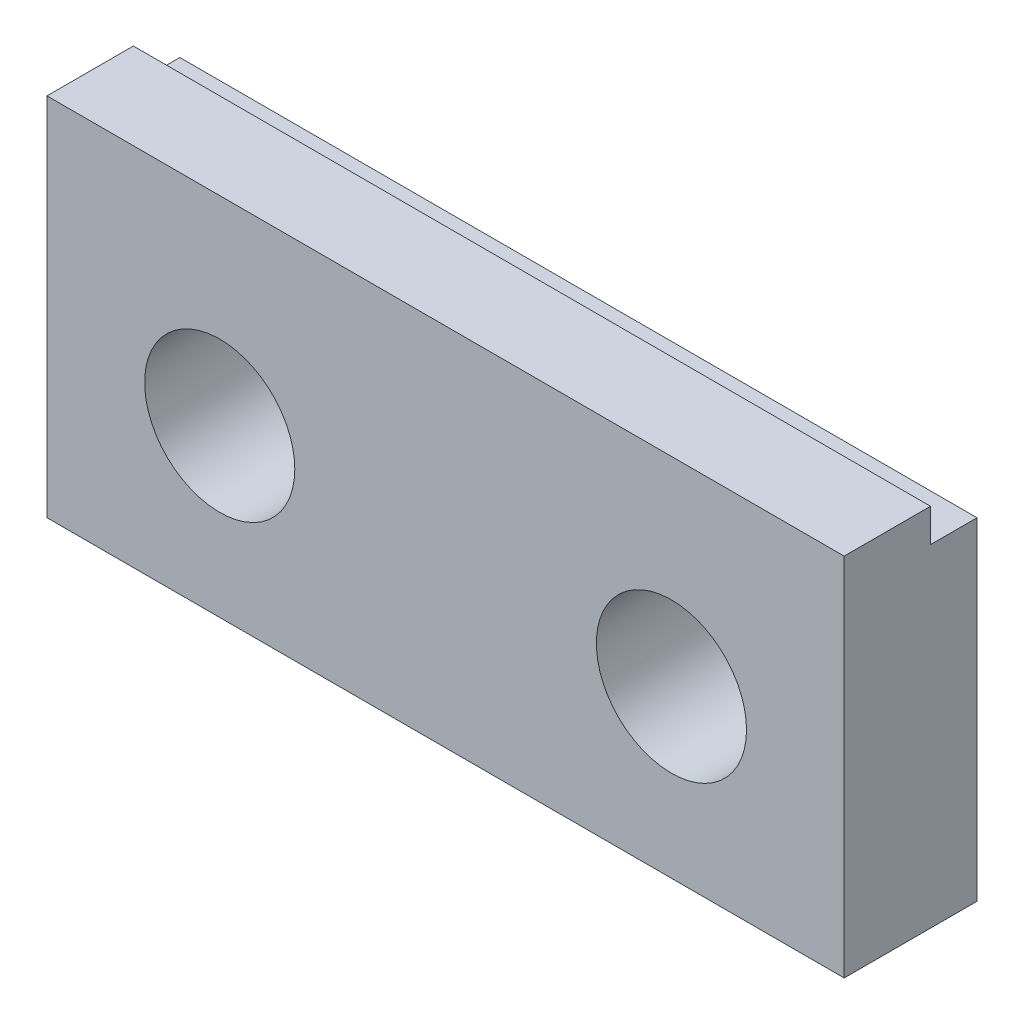
ISO-10303-21;
HEADER;
FILE_DESCRIPTION(('STEP AP214'),'2;1');
FILE_NAME('part.step','',(''),(''),'','','');
FILE_SCHEMA(('AUTOMOTIVE_DESIGN { 1 0 10303 214 1 1 1 1 }'));
ENDSEC;
DATA;
#1=APPLICATION_CONTEXT('core data for automotive mechanical design processes');
#2=APPLICATION_PROTOCOL_DEFINITION('international standard','automotive_design',2000,#1);
#3=PRODUCT_CONTEXT('',#1,'mechanical');
#4=PRODUCT('Part','Part','',(#3));
#5=PRODUCT_RELATED_PRODUCT_CATEGORY('part','',(#4));
#6=PRODUCT_DEFINITION_FORMATION('','',#4);
#7=PRODUCT_DEFINITION_CONTEXT('part definition',#1,'design');
#8=PRODUCT_DEFINITION('design','',#6,#7);
#9=PRODUCT_DEFINITION_SHAPE('','',#8);
#10=(LENGTH_UNIT() NAMED_UNIT(*) SI_UNIT(.MILLI.,.METRE.));
#11=(NAMED_UNIT(*) PLANE_ANGLE_UNIT() SI_UNIT($,.RADIAN.));
#12=(NAMED_UNIT(*) SI_UNIT($,.STERADIAN.) SOLID_ANGLE_UNIT());
#13=UNCERTAINTY_MEASURE_WITH_UNIT(LENGTH_MEASURE(1.E-05),#10,'distance_accuracy_value','');
#14=(GEOMETRIC_REPRESENTATION_CONTEXT(3) GLOBAL_UNCERTAINTY_ASSIGNED_CONTEXT((#13)) GLOBAL_UNIT_ASSIGNED_CONTEXT((#10,
#11,#12)) REPRESENTATION_CONTEXT('',''));
#15=CARTESIAN_POINT('',(0.,0.,0.));
#16=DIRECTION('',(0.,0.,1.));
#17=DIRECTION('',(1.,0.,0.));
#18=AXIS2_PLACEMENT_3D('',#15,#16,#17);
#19=CARTESIAN_POINT('',(-6.,3.,-2.));
#20=DIRECTION('',(-1.,0.,0.));
#21=DIRECTION('',(0.,-1.,0.));
#22=AXIS2_PLACEMENT_3D('',#19,#20,#21);
#23=PLANE('',#22);
#24=DIRECTION('',(0.,0.,-1.));
#25=VECTOR('',#24,1.);
#26=CARTESIAN_POINT('',(-6.,2.5,-2.));
#27=LINE('',#26,#25);
#28=CARTESIAN_POINT('',(-6.,2.5,-1.3));
#29=VERTEX_POINT('',#28);
#30=CARTESIAN_POINT('',(-6.,2.5,-2.));
#31=VERTEX_POINT('',#30);
#32=EDGE_CURVE('E130',#29,#31,#27,.T.);
#33=ORIENTED_EDGE('',*,*,#32,.T.);
#34=DIRECTION('',(0.,-1.,0.));
#35=VECTOR('',#34,1.);
#36=CARTESIAN_POINT('',(-6.,3.,-2.));
#37=LINE('',#36,#35);
#38=CARTESIAN_POINT('',(-6.,-2.5,-2.));
#39=VERTEX_POINT('',#38);
#40=EDGE_CURVE('E100',#31,#39,#37,.T.);
#41=ORIENTED_EDGE('',*,*,#40,.T.);
#42=DIRECTION('',(0.,0.,1.));
#43=VECTOR('',#42,1.);
#44=CARTESIAN_POINT('',(-6.,-2.5,-2.));
#45=LINE('',#44,#43);
#46=CARTESIAN_POINT('',(-6.,-2.5,0.));
#47=VERTEX_POINT('',#46);
#48=EDGE_CURVE('E36',#39,#47,#45,.T.);
#49=ORIENTED_EDGE('',*,*,#48,.T.);
#50=DIRECTION('',(0.,-1.,0.));
#51=VECTOR('',#50,1.);
#52=CARTESIAN_POINT('',(-6.,3.,0.));
#53=LINE('',#52,#51);
#54=CARTESIAN_POINT('',(-6.,3.,0.));
#55=VERTEX_POINT('',#54);
#56=EDGE_CURVE('E88',#55,#47,#53,.T.);
#57=ORIENTED_EDGE('',*,*,#56,.F.);
#58=DIRECTION('',(0.,0.,1.));
#59=VECTOR('',#58,1.);
#60=CARTESIAN_POINT('',(-6.,3.,-2.));
#61=LINE('',#60,#59);
#62=CARTESIAN_POINT('',(-6.,3.,-1.3));
#63=VERTEX_POINT('',#62);
#64=EDGE_CURVE('E11',#63,#55,#61,.T.);
#65=ORIENTED_EDGE('',*,*,#64,.F.);
#66=DIRECTION('',(0.,-1.,0.));
#67=VECTOR('',#66,1.);
#68=CARTESIAN_POINT('',(-6.,3.,-1.3));
#69=LINE('',#68,#67);
#70=EDGE_CURVE('E241',#63,#29,#69,.T.);
#71=ORIENTED_EDGE('',*,*,#70,.T.);
#72=EDGE_LOOP('',(#33,#41,#49,#57,#65,#71));
#73=FACE_BOUND('',#72,.T.);
#74=ADVANCED_FACE('F33',(#73),#23,.T.);
#75=CARTESIAN_POINT('',(-6.,3.,-2.));
#76=DIRECTION('',(0.,1.,0.));
#77=DIRECTION('',(0.,0.,1.));
#78=AXIS2_PLACEMENT_3D('',#75,#76,#77);
#79=PLANE('',#78);
#80=DIRECTION('',(1.,0.,0.));
#81=VECTOR('',#80,1.);
#82=CARTESIAN_POINT('',(-6.,3.,-1.3));
#83=LINE('',#82,#81);
#84=CARTESIAN_POINT('',(6.,3.,-1.3));
#85=VERTEX_POINT('',#84);
#86=EDGE_CURVE('E84',#63,#85,#83,.T.);
#87=ORIENTED_EDGE('',*,*,#86,.F.);
#88=ORIENTED_EDGE('',*,*,#64,.T.);
#89=DIRECTION('',(-1.,0.,0.));
#90=VECTOR('',#89,1.);
#91=CARTESIAN_POINT('',(-6.,3.,0.));
#92=LINE('',#91,#90);
#93=CARTESIAN_POINT('',(6.,3.,0.));
#94=VERTEX_POINT('',#93);
#95=EDGE_CURVE('E81',#94,#55,#92,.T.);
#96=ORIENTED_EDGE('',*,*,#95,.F.);
#97=DIRECTION('',(0.,0.,1.));
#98=VECTOR('',#97,1.);
#99=CARTESIAN_POINT('',(6.,3.,-2.));
#100=LINE('',#99,#98);
#101=EDGE_CURVE('E41',#85,#94,#100,.T.);
#102=ORIENTED_EDGE('',*,*,#101,.F.);
#103=EDGE_LOOP('',(#87,#88,#96,#102));
#104=FACE_BOUND('',#103,.T.);
#105=ADVANCED_FACE('F78',(#104),#79,.T.);
#106=CARTESIAN_POINT('',(6.,3.,-2.));
#107=DIRECTION('',(1.,0.,0.));
#108=DIRECTION('',(0.,0.,-1.));
#109=AXIS2_PLACEMENT_3D('',#106,#107,#108);
#110=PLANE('',#109);
#111=DIRECTION('',(0.,0.,-1.));
#112=VECTOR('',#111,1.);
#113=CARTESIAN_POINT('',(6.,2.5,-2.));
#114=LINE('',#113,#112);
#115=CARTESIAN_POINT('',(6.,2.5,-1.3));
#116=VERTEX_POINT('',#115);
#117=CARTESIAN_POINT('',(6.,2.5,-2.));
#118=VERTEX_POINT('',#117);
#119=EDGE_CURVE('E49',#116,#118,#114,.T.);
#120=ORIENTED_EDGE('',*,*,#119,.F.);
#121=DIRECTION('',(0.,-1.,0.));
#122=VECTOR('',#121,1.);
#123=CARTESIAN_POINT('',(6.,3.,-1.3));
#124=LINE('',#123,#122);
#125=EDGE_CURVE('E237',#85,#116,#124,.T.);
#126=ORIENTED_EDGE('',*,*,#125,.F.);
#127=ORIENTED_EDGE('',*,*,#101,.T.);
#128=DIRECTION('',(0.,1.,0.));
#129=VECTOR('',#128,1.);
#130=CARTESIAN_POINT('',(6.,3.,0.));
#131=LINE('',#130,#129);
#132=CARTESIAN_POINT('',(6.,-2.5,0.));
#133=VERTEX_POINT('',#132);
#134=EDGE_CURVE('E99',#133,#94,#131,.T.);
#135=ORIENTED_EDGE('',*,*,#134,.F.);
#136=DIRECTION('',(0.,0.,1.));
#137=VECTOR('',#136,1.);
#138=CARTESIAN_POINT('',(6.,-2.5,-2.));
#139=LINE('',#138,#137);
#140=CARTESIAN_POINT('',(6.,-2.5,-2.));
#141=VERTEX_POINT('',#140);
#142=EDGE_CURVE('E58',#141,#133,#139,.T.);
#143=ORIENTED_EDGE('',*,*,#142,.F.);
#144=DIRECTION('',(0.,1.,0.));
#145=VECTOR('',#144,1.);
#146=CARTESIAN_POINT('',(6.,3.,-2.));
#147=LINE('',#146,#145);
#148=EDGE_CURVE('E109',#141,#118,#147,.T.);
#149=ORIENTED_EDGE('',*,*,#148,.T.);
#150=EDGE_LOOP('',(#120,#126,#127,#135,#143,#149));
#151=FACE_BOUND('',#150,.T.);
#152=ADVANCED_FACE('F159',(#151),#110,.T.);
#153=CARTESIAN_POINT('',(-6.,-2.5,-2.));
#154=DIRECTION('',(0.,-1.,0.));
#155=DIRECTION('',(0.,0.,-1.));
#156=AXIS2_PLACEMENT_3D('',#153,#154,#155);
#157=PLANE('',#156);
#158=DIRECTION('',(1.,0.,0.));
#159=VECTOR('',#158,1.);
#160=CARTESIAN_POINT('',(-6.,-2.5,0.));
#161=LINE('',#160,#159);
#162=EDGE_CURVE('E94',#47,#133,#161,.T.);
#163=ORIENTED_EDGE('',*,*,#162,.F.);
#164=ORIENTED_EDGE('',*,*,#48,.F.);
#165=DIRECTION('',(1.,0.,0.));
#166=VECTOR('',#165,1.);
#167=CARTESIAN_POINT('',(-6.,-2.5,-2.));
#168=LINE('',#167,#166);
#169=EDGE_CURVE('E102',#39,#141,#168,.T.);
#170=ORIENTED_EDGE('',*,*,#169,.T.);
#171=ORIENTED_EDGE('',*,*,#142,.T.);
#172=EDGE_LOOP('',(#163,#164,#170,#171));
#173=FACE_BOUND('',#172,.T.);
#174=ADVANCED_FACE('F112',(#173),#157,.T.);
#175=CARTESIAN_POINT('',(-6.,-2.5,-2.));
#176=DIRECTION('',(0.,0.,1.));
#177=DIRECTION('',(1.,0.,0.));
#178=AXIS2_PLACEMENT_3D('',#175,#176,#177);
#179=PLANE('',#178);
#180=CARTESIAN_POINT('',(3.4,0.,-2.));
#181=DIRECTION('',(0.,0.,1.));
#182=DIRECTION('',(1.,0.,0.));
#183=AXIS2_PLACEMENT_3D('',#180,#181,#182);
#184=CIRCLE('',#183,1.1303);
#185=CARTESIAN_POINT('',(4.5303,0.,-2.));
#186=VERTEX_POINT('',#185);
#187=EDGE_CURVE('E123',#186,#186,#184,.T.);
#188=ORIENTED_EDGE('',*,*,#187,.T.);
#189=EDGE_LOOP('',(#188));
#190=FACE_BOUND('',#189,.T.);
#191=CARTESIAN_POINT('',(-3.4,0.,-2.));
#192=DIRECTION('',(0.,0.,1.));
#193=DIRECTION('',(1.,0.,0.));
#194=AXIS2_PLACEMENT_3D('',#191,#192,#193);
#195=CIRCLE('',#194,1.1303);
#196=CARTESIAN_POINT('',(-2.2697,0.,-2.));
#197=VERTEX_POINT('',#196);
#198=EDGE_CURVE('E95',#197,#197,#195,.T.);
#199=ORIENTED_EDGE('',*,*,#198,.T.);
#200=EDGE_LOOP('',(#199));
#201=FACE_BOUND('',#200,.T.);
#202=ORIENTED_EDGE('',*,*,#40,.F.);
#203=DIRECTION('',(1.,0.,0.));
#204=VECTOR('',#203,1.);
#205=CARTESIAN_POINT('',(-6.,2.5,-2.));
#206=LINE('',#205,#204);
#207=EDGE_CURVE('E117',#31,#118,#206,.T.);
#208=ORIENTED_EDGE('',*,*,#207,.T.);
#209=ORIENTED_EDGE('',*,*,#148,.F.);
#210=ORIENTED_EDGE('',*,*,#169,.F.);
#211=EDGE_LOOP('',(#202,#208,#209,#210));
#212=FACE_BOUND('',#211,.T.);
#213=ADVANCED_FACE('F116',(#190,#201,#212),#179,.F.);
#214=CARTESIAN_POINT('',(-6.,-2.5,0.));
#215=DIRECTION('',(0.,0.,1.));
#216=DIRECTION('',(1.,0.,0.));
#217=AXIS2_PLACEMENT_3D('',#214,#215,#216);
#218=PLANE('',#217);
#219=CARTESIAN_POINT('',(3.4,0.,0.));
#220=DIRECTION('',(0.,0.,1.));
#221=DIRECTION('',(1.,0.,0.));
#222=AXIS2_PLACEMENT_3D('',#219,#220,#221);
#223=CIRCLE('',#222,1.1303);
#224=CARTESIAN_POINT('',(4.5303,0.,0.));
#225=VERTEX_POINT('',#224);
#226=EDGE_CURVE('E119',#225,#225,#223,.T.);
#227=ORIENTED_EDGE('',*,*,#226,.F.);
#228=EDGE_LOOP('',(#227));
#229=FACE_BOUND('',#228,.T.);
#230=CARTESIAN_POINT('',(-3.4,0.,0.));
#231=DIRECTION('',(0.,0.,1.));
#232=DIRECTION('',(1.,0.,0.));
#233=AXIS2_PLACEMENT_3D('',#230,#231,#232);
#234=CIRCLE('',#233,1.1303);
#235=CARTESIAN_POINT('',(-2.2697,0.,0.));
#236=VERTEX_POINT('',#235);
#237=EDGE_CURVE('E132',#236,#236,#234,.T.);
#238=ORIENTED_EDGE('',*,*,#237,.F.);
#239=EDGE_LOOP('',(#238));
#240=FACE_BOUND('',#239,.T.);
#241=ORIENTED_EDGE('',*,*,#56,.T.);
#242=ORIENTED_EDGE('',*,*,#162,.T.);
#243=ORIENTED_EDGE('',*,*,#134,.T.);
#244=ORIENTED_EDGE('',*,*,#95,.T.);
#245=EDGE_LOOP('',(#241,#242,#243,#244));
#246=FACE_BOUND('',#245,.T.);
#247=ADVANCED_FACE('F98',(#229,#240,#246),#218,.T.);
#248=CARTESIAN_POINT('',(-3.4,0.,-2.));
#249=DIRECTION('',(0.,0.,1.));
#250=DIRECTION('',(1.,0.,0.));
#251=AXIS2_PLACEMENT_3D('',#248,#249,#250);
#252=CYLINDRICAL_SURFACE('',#251,1.1303);
#253=ORIENTED_EDGE('',*,*,#198,.F.);
#254=EDGE_LOOP('',(#253));
#255=FACE_BOUND('',#254,.T.);
#256=ORIENTED_EDGE('',*,*,#237,.T.);
#257=EDGE_LOOP('',(#256));
#258=FACE_BOUND('',#257,.T.);
#259=ADVANCED_FACE('F139',(#255,#258),#252,.F.);
#260=CARTESIAN_POINT('',(3.4,0.,-2.));
#261=DIRECTION('',(0.,0.,1.));
#262=DIRECTION('',(1.,0.,0.));
#263=AXIS2_PLACEMENT_3D('',#260,#261,#262);
#264=CYLINDRICAL_SURFACE('',#263,1.1303);
#265=ORIENTED_EDGE('',*,*,#187,.F.);
#266=EDGE_LOOP('',(#265));
#267=FACE_BOUND('',#266,.T.);
#268=ORIENTED_EDGE('',*,*,#226,.T.);
#269=EDGE_LOOP('',(#268));
#270=FACE_BOUND('',#269,.T.);
#271=ADVANCED_FACE('F148',(#267,#270),#264,.F.);
#272=CARTESIAN_POINT('',(-6.,2.5,-2.));
#273=DIRECTION('',(0.,-1.,0.));
#274=DIRECTION('',(0.,0.,-1.));
#275=AXIS2_PLACEMENT_3D('',#272,#273,#274);
#276=PLANE('',#275);
#277=ORIENTED_EDGE('',*,*,#119,.T.);
#278=ORIENTED_EDGE('',*,*,#207,.F.);
#279=ORIENTED_EDGE('',*,*,#32,.F.);
#280=DIRECTION('',(1.,0.,0.));
#281=VECTOR('',#280,1.);
#282=CARTESIAN_POINT('',(-6.,2.5,-1.3));
#283=LINE('',#282,#281);
#284=EDGE_CURVE('E120',#29,#116,#283,.T.);
#285=ORIENTED_EDGE('',*,*,#284,.T.);
#286=EDGE_LOOP('',(#277,#278,#279,#285));
#287=FACE_BOUND('',#286,.T.);
#288=ADVANCED_FACE('F181',(#287),#276,.F.);
#289=CARTESIAN_POINT('',(-6.,3.,-1.3));
#290=DIRECTION('',(0.,0.,1.));
#291=DIRECTION('',(1.,0.,0.));
#292=AXIS2_PLACEMENT_3D('',#289,#290,#291);
#293=PLANE('',#292);
#294=ORIENTED_EDGE('',*,*,#125,.T.);
#295=ORIENTED_EDGE('',*,*,#284,.F.);
#296=ORIENTED_EDGE('',*,*,#70,.F.);
#297=ORIENTED_EDGE('',*,*,#86,.T.);
#298=EDGE_LOOP('',(#294,#295,#296,#297));
#299=FACE_BOUND('',#298,.T.);
#300=ADVANCED_FACE('F186',(#299),#293,.F.);
#301=CLOSED_SHELL('',(#74,#105,#152,#174,#213,#247,#259,#271,#288,#300));
#302=MANIFOLD_SOLID_BREP('B2',#301);
#303=ADVANCED_BREP_SHAPE_REPRESENTATION('',(#18,#302),#14);
#304=SHAPE_DEFINITION_REPRESENTATION(#9,#303);
ENDSEC;
END-ISO-10303-21;
